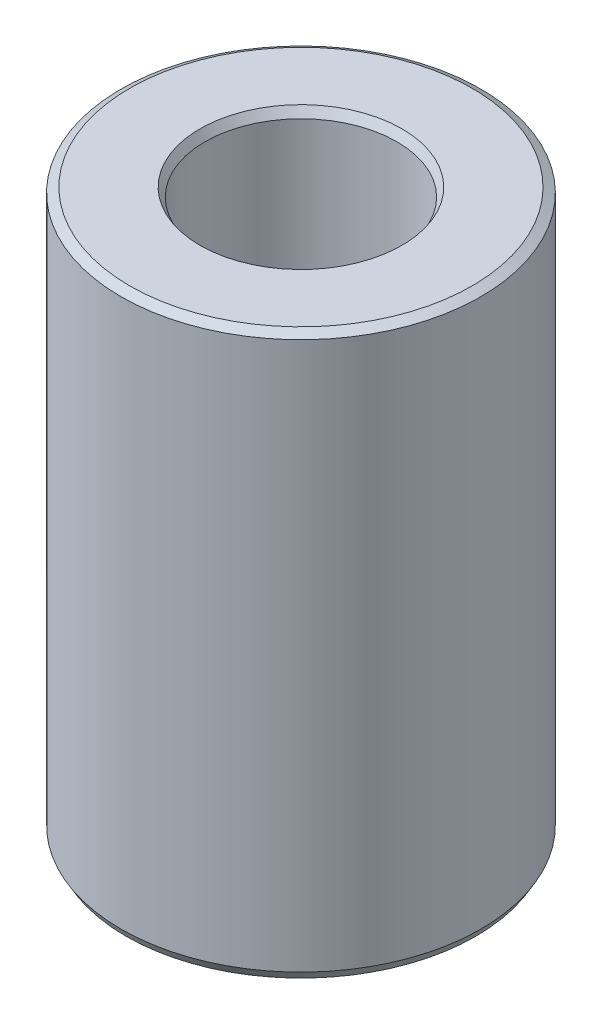
ISO-10303-21;
HEADER;
FILE_DESCRIPTION(('STEP AP214'),'2;1');
FILE_NAME('part.step','',(''),(''),'','','');
FILE_SCHEMA(('AUTOMOTIVE_DESIGN { 1 0 10303 214 1 1 1 1 }'));
ENDSEC;
DATA;
#1=APPLICATION_CONTEXT('core data for automotive mechanical design processes');
#2=APPLICATION_PROTOCOL_DEFINITION('international standard','automotive_design',2000,#1);
#3=PRODUCT_CONTEXT('',#1,'mechanical');
#4=PRODUCT('Part','Part','',(#3));
#5=PRODUCT_RELATED_PRODUCT_CATEGORY('part','',(#4));
#6=PRODUCT_DEFINITION_FORMATION('','',#4);
#7=PRODUCT_DEFINITION_CONTEXT('part definition',#1,'design');
#8=PRODUCT_DEFINITION('design','',#6,#7);
#9=PRODUCT_DEFINITION_SHAPE('','',#8);
#10=(LENGTH_UNIT() NAMED_UNIT(*) SI_UNIT(.MILLI.,.METRE.));
#11=(NAMED_UNIT(*) PLANE_ANGLE_UNIT() SI_UNIT($,.RADIAN.));
#12=(NAMED_UNIT(*) SI_UNIT($,.STERADIAN.) SOLID_ANGLE_UNIT());
#13=UNCERTAINTY_MEASURE_WITH_UNIT(LENGTH_MEASURE(1.E-05),#10,'distance_accuracy_value','');
#14=(GEOMETRIC_REPRESENTATION_CONTEXT(3) GLOBAL_UNCERTAINTY_ASSIGNED_CONTEXT((#13)) GLOBAL_UNIT_ASSIGNED_CONTEXT((#10,
#11,#12)) REPRESENTATION_CONTEXT('',''));
#15=CARTESIAN_POINT('',(0.,0.,0.));
#16=DIRECTION('',(0.,0.,1.));
#17=DIRECTION('',(1.,0.,0.));
#18=AXIS2_PLACEMENT_3D('',#15,#16,#17);
#19=CARTESIAN_POINT('',(0.,101.430636282709,0.));
#20=DIRECTION('',(0.,-1.,0.));
#21=DIRECTION('',(0.,0.,-1.));
#22=AXIS2_PLACEMENT_3D('',#19,#20,#21);
#23=CYLINDRICAL_SURFACE('',#22,32.5);
#24=CARTESIAN_POINT('',(0.,1.571681540788,0.));
#25=DIRECTION('',(0.,1.,0.));
#26=DIRECTION('',(0.,0.,1.));
#27=AXIS2_PLACEMENT_3D('',#24,#25,#26);
#28=CIRCLE('',#27,32.5);
#29=CARTESIAN_POINT('',(0.,1.571681540788,32.5));
#30=VERTEX_POINT('',#29);
#31=EDGE_CURVE('E10',#30,#30,#28,.T.);
#32=ORIENTED_EDGE('',*,*,#31,.T.);
#33=EDGE_LOOP('',(#32));
#34=FACE_BOUND('',#33,.T.);
#35=CARTESIAN_POINT('',(0.,100.523225522055,0.));
#36=DIRECTION('',(0.,1.,0.));
#37=DIRECTION('',(0.,0.,1.));
#38=AXIS2_PLACEMENT_3D('',#35,#36,#37);
#39=CIRCLE('',#38,32.5);
#40=CARTESIAN_POINT('',(0.,100.523225522055,32.5));
#41=VERTEX_POINT('',#40);
#42=EDGE_CURVE('E50',#41,#41,#39,.F.);
#43=ORIENTED_EDGE('',*,*,#42,.T.);
#44=EDGE_LOOP('',(#43));
#45=FACE_BOUND('',#44,.T.);
#46=ADVANCED_FACE('F39',(#34,#45),#23,.T.);
#47=CARTESIAN_POINT('',(0.,101.430636282709,0.));
#48=DIRECTION('',(0.,1.,0.));
#49=DIRECTION('',(0.,0.,1.));
#50=AXIS2_PLACEMENT_3D('',#47,#48,#49);
#51=PLANE('',#50);
#52=CARTESIAN_POINT('',(0.,101.430636282709,0.));
#53=DIRECTION('',(0.,1.,0.));
#54=DIRECTION('',(0.,0.,1.));
#55=AXIS2_PLACEMENT_3D('',#52,#53,#54);
#56=CIRCLE('',#55,18.245184449202);
#57=CARTESIAN_POINT('',(0.,101.430636282709,18.245184449202));
#58=VERTEX_POINT('',#57);
#59=EDGE_CURVE('E58',#58,#58,#56,.F.);
#60=ORIENTED_EDGE('',*,*,#59,.T.);
#61=EDGE_LOOP('',(#60));
#62=FACE_BOUND('',#61,.T.);
#63=CARTESIAN_POINT('',(0.,101.430636282709,0.));
#64=DIRECTION('',(0.,1.,0.));
#65=DIRECTION('',(0.,0.,1.));
#66=AXIS2_PLACEMENT_3D('',#63,#64,#65);
#67=CIRCLE('',#66,30.928318459212);
#68=CARTESIAN_POINT('',(0.,101.430636282709,30.928318459212));
#69=VERTEX_POINT('',#68);
#70=EDGE_CURVE('E61',#69,#69,#67,.T.);
#71=ORIENTED_EDGE('',*,*,#70,.T.);
#72=EDGE_LOOP('',(#71));
#73=FACE_BOUND('',#72,.T.);
#74=ADVANCED_FACE('F88',(#62,#73),#51,.T.);
#75=CARTESIAN_POINT('',(0.,0.,0.));
#76=DIRECTION('',(0.,1.,0.));
#77=DIRECTION('',(0.,0.,1.));
#78=AXIS2_PLACEMENT_3D('',#75,#76,#77);
#79=PLANE('',#78);
#80=CARTESIAN_POINT('',(0.,0.,0.));
#81=DIRECTION('',(0.,1.,0.));
#82=DIRECTION('',(0.,0.,1.));
#83=AXIS2_PLACEMENT_3D('',#80,#81,#82);
#84=CIRCLE('',#83,18.9094552293357);
#85=CARTESIAN_POINT('',(0.,0.,18.9094552293357));
#86=VERTEX_POINT('',#85);
#87=EDGE_CURVE('E51',#86,#86,#84,.T.);
#88=ORIENTED_EDGE('',*,*,#87,.T.);
#89=EDGE_LOOP('',(#88));
#90=FACE_BOUND('',#89,.T.);
#91=CARTESIAN_POINT('',(0.,0.,0.));
#92=DIRECTION('',(0.,1.,0.));
#93=DIRECTION('',(0.,0.,1.));
#94=AXIS2_PLACEMENT_3D('',#91,#92,#93);
#95=CIRCLE('',#94,31.5925892393457);
#96=CARTESIAN_POINT('',(0.,0.,31.5925892393457));
#97=VERTEX_POINT('',#96);
#98=EDGE_CURVE('E54',#97,#97,#95,.F.);
#99=ORIENTED_EDGE('',*,*,#98,.T.);
#100=EDGE_LOOP('',(#99));
#101=FACE_BOUND('',#100,.T.);
#102=ADVANCED_FACE('F83',(#90,#101),#79,.F.);
#103=CARTESIAN_POINT('',(0.,101.430636282709,0.));
#104=DIRECTION('',(0.,-1.,0.));
#105=DIRECTION('',(0.,0.,-1.));
#106=AXIS2_PLACEMENT_3D('',#103,#104,#105);
#107=CYLINDRICAL_SURFACE('',#106,17.3377736885477);
#108=CARTESIAN_POINT('',(0.,99.858954741921,0.));
#109=DIRECTION('',(0.,1.,0.));
#110=DIRECTION('',(0.,0.,1.));
#111=AXIS2_PLACEMENT_3D('',#108,#109,#110);
#112=CIRCLE('',#111,17.3377736885477);
#113=CARTESIAN_POINT('',(0.,99.858954741921,17.3377736885477));
#114=VERTEX_POINT('',#113);
#115=EDGE_CURVE('E67',#114,#114,#112,.T.);
#116=ORIENTED_EDGE('',*,*,#115,.T.);
#117=EDGE_LOOP('',(#116));
#118=FACE_BOUND('',#117,.T.);
#119=CARTESIAN_POINT('',(0.,0.907410760654301,0.));
#120=DIRECTION('',(0.,1.,0.));
#121=DIRECTION('',(0.,0.,1.));
#122=AXIS2_PLACEMENT_3D('',#119,#120,#121);
#123=CIRCLE('',#122,17.3377736885477);
#124=CARTESIAN_POINT('',(0.,0.907410760654301,17.3377736885477));
#125=VERTEX_POINT('',#124);
#126=EDGE_CURVE('E69',#125,#125,#123,.F.);
#127=ORIENTED_EDGE('',*,*,#126,.T.);
#128=EDGE_LOOP('',(#127));
#129=FACE_BOUND('',#128,.T.);
#130=ADVANCED_FACE('F71',(#118,#129),#107,.F.);
#131=CARTESIAN_POINT('',(0.,99.858954741921,0.));
#132=DIRECTION('',(0.,1.,0.));
#133=DIRECTION('',(0.,0.,1.));
#134=AXIS2_PLACEMENT_3D('',#131,#132,#133);
#135=CONICAL_SURFACE('',#134,17.3377736885477,0.5235987755983);
#136=CARTESIAN_POINT('',(0.,101.430636282709,18.245184449202));
#137=CARTESIAN_POINT('',(0.,101.414264599992,18.2357322537785));
#138=CARTESIAN_POINT('',(0.,101.397892917276,18.2262800583551));
#139=CARTESIAN_POINT('',(0.,101.365149551843,18.2073756675081));
#140=CARTESIAN_POINT('',(0.,101.348777869126,18.1979234720846));
#141=CARTESIAN_POINT('',(0.,101.316034503693,18.1790190812376));
#142=CARTESIAN_POINT('',(0.,101.299662820977,18.1695668858142));
#143=CARTESIAN_POINT('',(0.,101.266919455544,18.1506624949672));
#144=CARTESIAN_POINT('',(0.,101.250547772827,18.1412102995437));
#145=CARTESIAN_POINT('',(0.,101.217804407394,18.1223059086967));
#146=CARTESIAN_POINT('',(0.,101.201432724677,18.1128537132733));
#147=CARTESIAN_POINT('',(0.,101.168689359244,18.0939493224263));
#148=CARTESIAN_POINT('',(0.,101.152317676528,18.0844971270028));
#149=CARTESIAN_POINT('',(0.,101.119574311095,18.0655927361559));
#150=CARTESIAN_POINT('',(0.,101.103202628378,18.0561405407324));
#151=CARTESIAN_POINT('',(0.,101.070459262945,18.0372361498854));
#152=CARTESIAN_POINT('',(0.,101.054087580228,18.0277839544619));
#153=CARTESIAN_POINT('',(0.,101.021344214795,18.008879563615));
#154=CARTESIAN_POINT('',(0.,101.004972532079,17.9994273681915));
#155=CARTESIAN_POINT('',(0.,100.972229166646,17.9805229773445));
#156=CARTESIAN_POINT('',(0.,100.955857483929,17.971070781921));
#157=CARTESIAN_POINT('',(0.,100.923114118496,17.9521663910741));
#158=CARTESIAN_POINT('',(0.,100.90674243578,17.9427141956506));
#159=CARTESIAN_POINT('',(0.,100.873999070347,17.9238098048036));
#160=CARTESIAN_POINT('',(0.,100.85762738763,17.9143576093801));
#161=CARTESIAN_POINT('',(0.,100.824884022197,17.8954532185332));
#162=CARTESIAN_POINT('',(0.,100.80851233948,17.8860010231097));
#163=CARTESIAN_POINT('',(0.,100.775768974047,17.8670966322627));
#164=CARTESIAN_POINT('',(0.,100.759397291331,17.8576444368393));
#165=CARTESIAN_POINT('',(0.,100.726653925898,17.8387400459923));
#166=CARTESIAN_POINT('',(0.,100.710282243181,17.8292878505688));
#167=CARTESIAN_POINT('',(0.,100.677538877748,17.8103834597218));
#168=CARTESIAN_POINT('',(0.,100.661167195031,17.8009312642984));
#169=CARTESIAN_POINT('',(0.,100.628423829598,17.7820268734514));
#170=CARTESIAN_POINT('',(0.,100.612052146882,17.7725746780279));
#171=CARTESIAN_POINT('',(0.,100.579308781449,17.753670287181));
#172=CARTESIAN_POINT('',(0.,100.562937098732,17.7442180917575));
#173=CARTESIAN_POINT('',(0.,100.530193733299,17.7253137009105));
#174=CARTESIAN_POINT('',(0.,100.513822050583,17.715861505487));
#175=CARTESIAN_POINT('',(0.,100.48107868515,17.6969571146401));
#176=CARTESIAN_POINT('',(0.,100.464707002433,17.6875049192166));
#177=CARTESIAN_POINT('',(0.,100.431963637,17.6686005283696));
#178=CARTESIAN_POINT('',(0.,100.415591954283,17.6591483329461));
#179=CARTESIAN_POINT('',(0.,100.38284858885,17.6402439420992));
#180=CARTESIAN_POINT('',(0.,100.366476906134,17.6307917466757));
#181=CARTESIAN_POINT('',(0.,100.333733540701,17.6118873558287));
#182=CARTESIAN_POINT('',(0.,100.317361857984,17.6024351604052));
#183=CARTESIAN_POINT('',(0.,100.284618492551,17.5835307695583));
#184=CARTESIAN_POINT('',(0.,100.268246809835,17.5740785741348));
#185=CARTESIAN_POINT('',(0.,100.235503444401,17.5551741832878));
#186=CARTESIAN_POINT('',(0.,100.219131761685,17.5457219878644));
#187=CARTESIAN_POINT('',(0.,100.186388396252,17.5268175970174));
#188=CARTESIAN_POINT('',(0.,100.170016713535,17.5173654015939));
#189=CARTESIAN_POINT('',(0.,100.137273348102,17.4984610107469));
#190=CARTESIAN_POINT('',(0.,100.120901665386,17.4890088153235));
#191=CARTESIAN_POINT('',(0.,100.088158299953,17.4701044244765));
#192=CARTESIAN_POINT('',(0.,100.071786617236,17.460652229053));
#193=CARTESIAN_POINT('',(0.,100.039043251803,17.441747838206));
#194=CARTESIAN_POINT('',(0.,100.022671569086,17.4322956427826));
#195=CARTESIAN_POINT('',(0.,99.9899282036533,17.4133912519356));
#196=CARTESIAN_POINT('',(0.,99.9735565209368,17.4039390565121));
#197=CARTESIAN_POINT('',(0.,99.9408131555037,17.3850346656652));
#198=CARTESIAN_POINT('',(0.,99.9244414727872,17.3755824702417));
#199=CARTESIAN_POINT('',(0.,99.8916981073541,17.3566780793947));
#200=CARTESIAN_POINT('',(0.,99.8753264246375,17.3472258839712));
#201=CARTESIAN_POINT('',(0.,99.858954741921,17.3377736885477));
#202=B_SPLINE_CURVE_WITH_KNOTS('',3,(#136,#137,#138,#139,#140,#141,#142,#143,#144,#145,#146,
#147,#148,#149,#150,#151,#152,#153,#154,#155,#156,#157,#158,#159,#160,#161,#162,#163,#164,#165,
#166,#167,#168,#169,#170,#171,#172,#173,#174,#175,#176,#177,#178,#179,#180,#181,#182,#183,#184,
#185,#186,#187,#188,#189,#190,#191,#192,#193,#194,#195,#196,#197,#198,#199,#200,#201),
.UNSPECIFIED.,.F.,.F.,(4,2,2,2,2,2,2,2,2,2,2,2,2,2,2,2,2,2,2,2,2,2,2,2,2,2,2,2,2,2,2,2,4),(0.,
0.0567131725408944,0.113426345081789,0.170139517622683,0.226852690163579,0.283565862704462,
0.340279035245356,0.39699220778625,0.453705380327145,0.510418552868039,0.567131725408922,
0.623844897949816,0.680558070490712,0.737271243031606,0.793984415572489,0.850697588113383,
0.907410760654278,0.964123933195172,1.02083710573607,1.07755027827695,1.13426345081784,
1.19097662335874,1.24768979589963,1.30440296844052,1.36111614098141,1.41782931352231,
1.4745424860632,1.5312556586041,1.58796883114498,1.64468200368587,1.70139517622677,
1.75810834876766,1.81482152130854),.UNSPECIFIED.);
#203=EDGE_CURVE('BSEAM77',#58,#114,#202,.T.);
#204=ORIENTED_EDGE('',*,*,#59,.F.);
#205=ORIENTED_EDGE('',*,*,#115,.F.);
#206=ORIENTED_EDGE('',*,*,#203,.T.);
#207=ORIENTED_EDGE('',*,*,#203,.F.);
#208=EDGE_LOOP('',(#204,#206,#205,#207));
#209=FACE_BOUND('',#208,.T.);
#210=ADVANCED_FACE('F77',(#209),#135,.F.);
#211=CARTESIAN_POINT('',(0.,0.,0.));
#212=DIRECTION('',(0.,-1.,0.));
#213=DIRECTION('',(0.,0.,-1.));
#214=AXIS2_PLACEMENT_3D('',#211,#212,#213);
#215=CONICAL_SURFACE('',#214,18.9094552293357,1.0471975511966);
#216=ORIENTED_EDGE('',*,*,#126,.F.);
#217=EDGE_LOOP('',(#216));
#218=FACE_BOUND('',#217,.T.);
#219=ORIENTED_EDGE('',*,*,#87,.F.);
#220=EDGE_LOOP('',(#219));
#221=FACE_BOUND('',#220,.T.);
#222=ADVANCED_FACE('F73',(#218,#221),#215,.F.);
#223=CARTESIAN_POINT('',(0.,1.571681540788,0.));
#224=DIRECTION('',(0.,1.,0.));
#225=DIRECTION('',(0.,0.,1.));
#226=AXIS2_PLACEMENT_3D('',#223,#224,#225);
#227=CONICAL_SURFACE('',#226,32.5,0.5235987755983);
#228=ORIENTED_EDGE('',*,*,#98,.F.);
#229=EDGE_LOOP('',(#228));
#230=FACE_BOUND('',#229,.T.);
#231=ORIENTED_EDGE('',*,*,#31,.F.);
#232=EDGE_LOOP('',(#231));
#233=FACE_BOUND('',#232,.T.);
#234=ADVANCED_FACE('F76',(#230,#233),#227,.T.);
#235=CARTESIAN_POINT('',(0.,101.430636282709,0.));
#236=DIRECTION('',(0.,-1.,0.));
#237=DIRECTION('',(0.,0.,-1.));
#238=AXIS2_PLACEMENT_3D('',#235,#236,#237);
#239=CONICAL_SURFACE('',#238,30.928318459212,1.0471975511966);
#240=ORIENTED_EDGE('',*,*,#42,.F.);
#241=EDGE_LOOP('',(#240));
#242=FACE_BOUND('',#241,.T.);
#243=ORIENTED_EDGE('',*,*,#70,.F.);
#244=EDGE_LOOP('',(#243));
#245=FACE_BOUND('',#244,.T.);
#246=ADVANCED_FACE('F45',(#242,#245),#239,.T.);
#247=CLOSED_SHELL('',(#46,#74,#102,#130,#210,#222,#234,#246));
#248=MANIFOLD_SOLID_BREP('B2',#247);
#249=ADVANCED_BREP_SHAPE_REPRESENTATION('',(#18,#248),#14);
#250=SHAPE_DEFINITION_REPRESENTATION(#9,#249);
ENDSEC;
END-ISO-10303-21;
